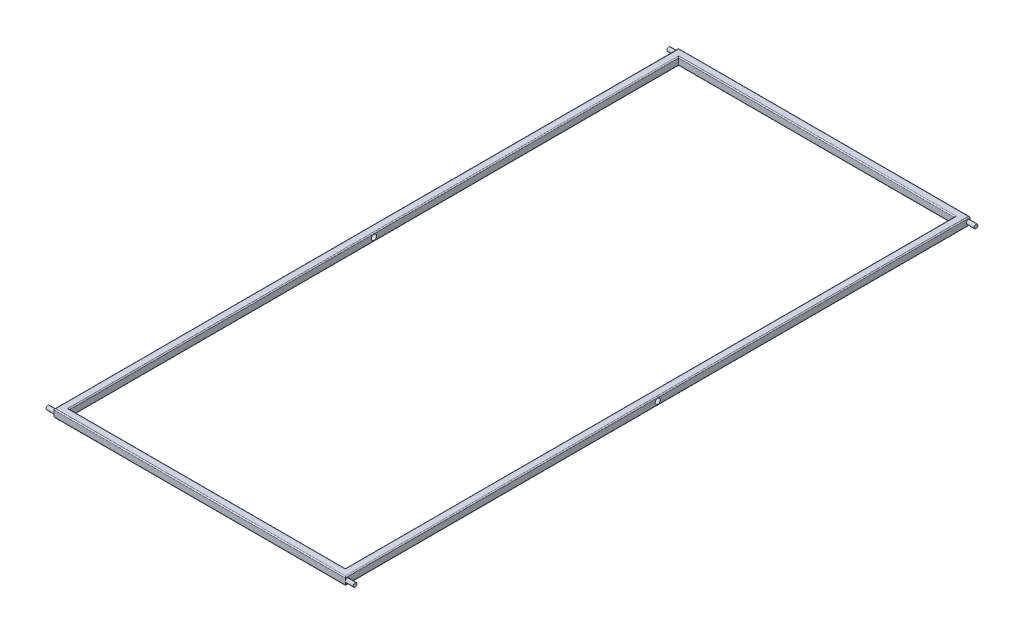
ISO-10303-21;
HEADER;
FILE_DESCRIPTION(('STEP AP214'),'2;1');
FILE_NAME('part.step','',(''),(''),'','','');
FILE_SCHEMA(('AUTOMOTIVE_DESIGN { 1 0 10303 214 1 1 1 1 }'));
ENDSEC;
DATA;
#1=APPLICATION_CONTEXT('core data for automotive mechanical design processes');
#2=APPLICATION_PROTOCOL_DEFINITION('international standard','automotive_design',2000,#1);
#3=PRODUCT_CONTEXT('',#1,'mechanical');
#4=PRODUCT('Part','Part','',(#3));
#5=PRODUCT_RELATED_PRODUCT_CATEGORY('part','',(#4));
#6=PRODUCT_DEFINITION_FORMATION('','',#4);
#7=PRODUCT_DEFINITION_CONTEXT('part definition',#1,'design');
#8=PRODUCT_DEFINITION('design','',#6,#7);
#9=PRODUCT_DEFINITION_SHAPE('','',#8);
#10=(LENGTH_UNIT() NAMED_UNIT(*) SI_UNIT(.MILLI.,.METRE.));
#11=(NAMED_UNIT(*) PLANE_ANGLE_UNIT() SI_UNIT($,.RADIAN.));
#12=(NAMED_UNIT(*) SI_UNIT($,.STERADIAN.) SOLID_ANGLE_UNIT());
#13=UNCERTAINTY_MEASURE_WITH_UNIT(LENGTH_MEASURE(1.E-05),#10,'distance_accuracy_value','');
#14=(GEOMETRIC_REPRESENTATION_CONTEXT(3) GLOBAL_UNCERTAINTY_ASSIGNED_CONTEXT((#13)) GLOBAL_UNIT_ASSIGNED_CONTEXT((#10,
#11,#12)) REPRESENTATION_CONTEXT('',''));
#15=CARTESIAN_POINT('',(0.,0.,0.));
#16=DIRECTION('',(0.,0.,1.));
#17=DIRECTION('',(1.,0.,0.));
#18=AXIS2_PLACEMENT_3D('',#15,#16,#17);
#19=CARTESIAN_POINT('',(0.,19.5,0.));
#20=DIRECTION('',(0.,-1.,0.));
#21=DIRECTION('',(0.,0.,-1.));
#22=AXIS2_PLACEMENT_3D('',#19,#20,#21);
#23=PLANE('',#22);
#24=DIRECTION('',(0.,0.,-1.));
#25=VECTOR('',#24,1.);
#26=CARTESIAN_POINT('',(347.1,19.5,760.5));
#27=LINE('',#26,#25);
#28=CARTESIAN_POINT('',(347.1,19.5,-763.1));
#29=VERTEX_POINT('',#28);
#30=CARTESIAN_POINT('',(347.1,19.5,763.1));
#31=VERTEX_POINT('',#30);
#32=EDGE_CURVE('E212',#29,#31,#27,.F.);
#33=ORIENTED_EDGE('',*,*,#32,.T.);
#34=DIRECTION('',(1.,0.,0.));
#35=VECTOR('',#34,1.);
#36=CARTESIAN_POINT('',(-344.5,19.5,763.1));
#37=LINE('',#36,#35);
#38=CARTESIAN_POINT('',(-347.1,19.5,763.1));
#39=VERTEX_POINT('',#38);
#40=EDGE_CURVE('E221',#31,#39,#37,.F.);
#41=ORIENTED_EDGE('',*,*,#40,.T.);
#42=DIRECTION('',(0.,0.,1.));
#43=VECTOR('',#42,1.);
#44=CARTESIAN_POINT('',(-347.1,19.5,-760.5));
#45=LINE('',#44,#43);
#46=CARTESIAN_POINT('',(-347.1,19.5,-763.1));
#47=VERTEX_POINT('',#46);
#48=EDGE_CURVE('E218',#39,#47,#45,.F.);
#49=ORIENTED_EDGE('',*,*,#48,.T.);
#50=DIRECTION('',(-1.,0.,0.));
#51=VECTOR('',#50,1.);
#52=CARTESIAN_POINT('',(344.5,19.5,-763.1));
#53=LINE('',#52,#51);
#54=EDGE_CURVE('E215',#47,#29,#53,.F.);
#55=ORIENTED_EDGE('',*,*,#54,.T.);
#56=EDGE_LOOP('',(#33,#41,#49,#55));
#57=FACE_BOUND('',#56,.T.);
#58=DIRECTION('',(1.,0.,0.));
#59=VECTOR('',#58,1.);
#60=CARTESIAN_POINT('',(0.,19.5,777.4));
#61=LINE('',#60,#59);
#62=CARTESIAN_POINT('',(-361.4,19.5,777.4));
#63=VERTEX_POINT('',#62);
#64=CARTESIAN_POINT('',(361.4,19.5,777.4));
#65=VERTEX_POINT('',#64);
#66=EDGE_CURVE('E205',#63,#65,#61,.T.);
#67=ORIENTED_EDGE('',*,*,#66,.T.);
#68=DIRECTION('',(0.,0.,-1.));
#69=VECTOR('',#68,1.);
#70=CARTESIAN_POINT('',(361.4,19.5,0.));
#71=LINE('',#70,#69);
#72=CARTESIAN_POINT('',(361.4,19.5,-777.4));
#73=VERTEX_POINT('',#72);
#74=EDGE_CURVE('E208',#65,#73,#71,.T.);
#75=ORIENTED_EDGE('',*,*,#74,.T.);
#76=DIRECTION('',(-1.,0.,0.));
#77=VECTOR('',#76,1.);
#78=CARTESIAN_POINT('',(0.,19.5,-777.4));
#79=LINE('',#78,#77);
#80=CARTESIAN_POINT('',(-361.4,19.5,-777.4));
#81=VERTEX_POINT('',#80);
#82=EDGE_CURVE('E199',#73,#81,#79,.T.);
#83=ORIENTED_EDGE('',*,*,#82,.T.);
#84=DIRECTION('',(0.,0.,1.));
#85=VECTOR('',#84,1.);
#86=CARTESIAN_POINT('',(-361.4,19.5,0.));
#87=LINE('',#86,#85);
#88=EDGE_CURVE('E202',#81,#63,#87,.T.);
#89=ORIENTED_EDGE('',*,*,#88,.T.);
#90=EDGE_LOOP('',(#67,#75,#83,#89));
#91=FACE_BOUND('',#90,.T.);
#92=ADVANCED_FACE('F38',(#57,#91),#23,.F.);
#93=CARTESIAN_POINT('',(0.,0.,0.));
#94=DIRECTION('',(0.,-1.,0.));
#95=DIRECTION('',(0.,0.,-1.));
#96=AXIS2_PLACEMENT_3D('',#93,#94,#95);
#97=PLANE('',#96);
#98=DIRECTION('',(-1.,0.,0.));
#99=VECTOR('',#98,1.);
#100=CARTESIAN_POINT('',(0.,0.,-763.1));
#101=LINE('',#100,#99);
#102=CARTESIAN_POINT('',(347.1,0.,-763.1));
#103=VERTEX_POINT('',#102);
#104=CARTESIAN_POINT('',(-347.1,0.,-763.1));
#105=VERTEX_POINT('',#104);
#106=EDGE_CURVE('E295',#103,#105,#101,.T.);
#107=ORIENTED_EDGE('',*,*,#106,.T.);
#108=DIRECTION('',(0.,0.,1.));
#109=VECTOR('',#108,1.);
#110=CARTESIAN_POINT('',(-347.1,0.,0.));
#111=LINE('',#110,#109);
#112=CARTESIAN_POINT('',(-347.1,0.,763.1));
#113=VERTEX_POINT('',#112);
#114=EDGE_CURVE('E298',#105,#113,#111,.T.);
#115=ORIENTED_EDGE('',*,*,#114,.T.);
#116=DIRECTION('',(1.,0.,0.));
#117=VECTOR('',#116,1.);
#118=CARTESIAN_POINT('',(0.,0.,763.1));
#119=LINE('',#118,#117);
#120=CARTESIAN_POINT('',(347.1,0.,763.1));
#121=VERTEX_POINT('',#120);
#122=EDGE_CURVE('E289',#113,#121,#119,.T.);
#123=ORIENTED_EDGE('',*,*,#122,.T.);
#124=DIRECTION('',(0.,0.,-1.));
#125=VECTOR('',#124,1.);
#126=CARTESIAN_POINT('',(347.1,0.,0.));
#127=LINE('',#126,#125);
#128=EDGE_CURVE('E292',#121,#103,#127,.T.);
#129=ORIENTED_EDGE('',*,*,#128,.T.);
#130=EDGE_LOOP('',(#107,#115,#123,#129));
#131=FACE_BOUND('',#130,.T.);
#132=DIRECTION('',(0.,0.,1.));
#133=VECTOR('',#132,1.);
#134=CARTESIAN_POINT('',(-361.4,0.,-780.));
#135=LINE('',#134,#133);
#136=CARTESIAN_POINT('',(-361.4,0.,777.4));
#137=VERTEX_POINT('',#136);
#138=CARTESIAN_POINT('',(-361.4,0.,-777.4));
#139=VERTEX_POINT('',#138);
#140=EDGE_CURVE('E282',#137,#139,#135,.F.);
#141=ORIENTED_EDGE('',*,*,#140,.T.);
#142=DIRECTION('',(-1.,0.,0.));
#143=VECTOR('',#142,1.);
#144=CARTESIAN_POINT('',(364.,0.,-777.4));
#145=LINE('',#144,#143);
#146=CARTESIAN_POINT('',(361.4,0.,-777.4));
#147=VERTEX_POINT('',#146);
#148=EDGE_CURVE('E285',#139,#147,#145,.F.);
#149=ORIENTED_EDGE('',*,*,#148,.T.);
#150=DIRECTION('',(0.,0.,-1.));
#151=VECTOR('',#150,1.);
#152=CARTESIAN_POINT('',(361.4,0.,780.));
#153=LINE('',#152,#151);
#154=CARTESIAN_POINT('',(361.4,0.,777.4));
#155=VERTEX_POINT('',#154);
#156=EDGE_CURVE('E246',#147,#155,#153,.F.);
#157=ORIENTED_EDGE('',*,*,#156,.T.);
#158=DIRECTION('',(1.,0.,0.));
#159=VECTOR('',#158,1.);
#160=CARTESIAN_POINT('',(-364.,0.,777.4));
#161=LINE('',#160,#159);
#162=EDGE_CURVE('E279',#155,#137,#161,.F.);
#163=ORIENTED_EDGE('',*,*,#162,.T.);
#164=EDGE_LOOP('',(#141,#149,#157,#163));
#165=FACE_BOUND('',#164,.T.);
#166=ADVANCED_FACE('F361',(#131,#165),#97,.T.);
#167=CARTESIAN_POINT('',(364.,19.5,780.));
#168=DIRECTION('',(-1.,0.,0.));
#169=DIRECTION('',(0.,0.,1.));
#170=AXIS2_PLACEMENT_3D('',#167,#168,#169);
#171=PLANE('',#170);
#172=CARTESIAN_POINT('',(364.,9.75,1.4432899320127E-13));
#173=DIRECTION('',(-1.,0.,0.));
#174=DIRECTION('',(0.,0.,1.));
#175=AXIS2_PLACEMENT_3D('',#172,#173,#174);
#176=CIRCLE('',#175,6.5);
#177=CARTESIAN_POINT('',(364.,9.75,6.50000000000015));
#178=VERTEX_POINT('',#177);
#179=EDGE_CURVE('E418',#178,#178,#176,.T.);
#180=ORIENTED_EDGE('',*,*,#179,.T.);
#181=EDGE_LOOP('',(#180));
#182=FACE_BOUND('',#181,.T.);
#183=DIRECTION('',(0.,-1.,0.));
#184=VECTOR('',#183,1.);
#185=CARTESIAN_POINT('',(364.,19.5,-780.));
#186=LINE('',#185,#184);
#187=CARTESIAN_POINT('',(364.,9.75,-780.));
#188=VERTEX_POINT('',#187);
#189=CARTESIAN_POINT('',(364.,2.6,-780.));
#190=VERTEX_POINT('',#189);
#191=EDGE_CURVE('E175',#188,#190,#186,.T.);
#192=ORIENTED_EDGE('',*,*,#191,.F.);
#193=CARTESIAN_POINT('',(364.,9.75,-775.125));
#194=DIRECTION('',(-1.,0.,0.));
#195=DIRECTION('',(0.,0.,-1.));
#196=AXIS2_PLACEMENT_3D('',#193,#194,#195);
#197=CIRCLE('',#196,4.87499999999997);
#198=EDGE_CURVE('E54',#188,#188,#197,.T.);
#199=ORIENTED_EDGE('',*,*,#198,.T.);
#200=CARTESIAN_POINT('',(364.,16.9,-780.));
#201=VERTEX_POINT('',#200);
#202=EDGE_CURVE('E192',#201,#188,#186,.T.);
#203=ORIENTED_EDGE('',*,*,#202,.F.);
#204=DIRECTION('',(0.,0.,-1.));
#205=VECTOR('',#204,1.);
#206=CARTESIAN_POINT('',(364.,16.9,780.));
#207=LINE('',#206,#205);
#208=CARTESIAN_POINT('',(364.,16.9,780.));
#209=VERTEX_POINT('',#208);
#210=EDGE_CURVE('E234',#201,#209,#207,.F.);
#211=ORIENTED_EDGE('',*,*,#210,.T.);
#212=DIRECTION('',(0.,-1.,0.));
#213=VECTOR('',#212,1.);
#214=CARTESIAN_POINT('',(364.,19.5,780.));
#215=LINE('',#214,#213);
#216=CARTESIAN_POINT('',(364.,9.75,780.));
#217=VERTEX_POINT('',#216);
#218=EDGE_CURVE('E375',#209,#217,#215,.T.);
#219=ORIENTED_EDGE('',*,*,#218,.T.);
#220=CARTESIAN_POINT('',(364.,9.75,775.125));
#221=DIRECTION('',(-1.,0.,0.));
#222=DIRECTION('',(0.,0.,1.));
#223=AXIS2_PLACEMENT_3D('',#220,#221,#222);
#224=CIRCLE('',#223,4.87499999999997);
#225=EDGE_CURVE('E59',#217,#217,#224,.T.);
#226=ORIENTED_EDGE('',*,*,#225,.T.);
#227=CARTESIAN_POINT('',(364.,2.6,780.));
#228=VERTEX_POINT('',#227);
#229=EDGE_CURVE('E378',#217,#228,#215,.T.);
#230=ORIENTED_EDGE('',*,*,#229,.T.);
#231=DIRECTION('',(0.,0.,-1.));
#232=VECTOR('',#231,1.);
#233=CARTESIAN_POINT('',(364.,2.6,-780.));
#234=LINE('',#233,#232);
#235=EDGE_CURVE('E11',#228,#190,#234,.T.);
#236=ORIENTED_EDGE('',*,*,#235,.T.);
#237=EDGE_LOOP('',(#192,#199,#203,#211,#219,#226,#230,#236));
#238=FACE_BOUND('',#237,.T.);
#239=ADVANCED_FACE('F497',(#182,#238),#171,.F.);
#240=CARTESIAN_POINT('',(-364.,19.5,-780.));
#241=DIRECTION('',(0.,0.,1.));
#242=DIRECTION('',(1.,0.,0.));
#243=AXIS2_PLACEMENT_3D('',#240,#241,#242);
#244=PLANE('',#243);
#245=ORIENTED_EDGE('',*,*,#202,.T.);
#246=ORIENTED_EDGE('',*,*,#191,.T.);
#247=DIRECTION('',(-1.,0.,0.));
#248=VECTOR('',#247,1.);
#249=CARTESIAN_POINT('',(-364.,2.6,-780.));
#250=LINE('',#249,#248);
#251=CARTESIAN_POINT('',(-364.,2.6,-780.));
#252=VERTEX_POINT('',#251);
#253=EDGE_CURVE('E182',#190,#252,#250,.T.);
#254=ORIENTED_EDGE('',*,*,#253,.T.);
#255=DIRECTION('',(0.,-1.,0.));
#256=VECTOR('',#255,1.);
#257=CARTESIAN_POINT('',(-364.,19.5,-780.));
#258=LINE('',#257,#256);
#259=CARTESIAN_POINT('',(-364.,9.75,-780.));
#260=VERTEX_POINT('',#259);
#261=EDGE_CURVE('E176',#260,#252,#258,.T.);
#262=ORIENTED_EDGE('',*,*,#261,.F.);
#263=CARTESIAN_POINT('',(-364.,16.9,-780.));
#264=VERTEX_POINT('',#263);
#265=EDGE_CURVE('E164',#264,#260,#258,.T.);
#266=ORIENTED_EDGE('',*,*,#265,.F.);
#267=DIRECTION('',(-1.,0.,0.));
#268=VECTOR('',#267,1.);
#269=CARTESIAN_POINT('',(-364.,16.9,-780.));
#270=LINE('',#269,#268);
#271=EDGE_CURVE('E243',#264,#201,#270,.F.);
#272=ORIENTED_EDGE('',*,*,#271,.T.);
#273=EDGE_LOOP('',(#245,#246,#254,#262,#266,#272));
#274=FACE_BOUND('',#273,.T.);
#275=ADVANCED_FACE('F180',(#274),#244,.F.);
#276=CARTESIAN_POINT('',(-364.,19.5,780.));
#277=DIRECTION('',(1.,0.,0.));
#278=DIRECTION('',(0.,0.,-1.));
#279=AXIS2_PLACEMENT_3D('',#276,#277,#278);
#280=PLANE('',#279);
#281=CARTESIAN_POINT('',(-364.,9.75,1.4432899320127E-13));
#282=DIRECTION('',(-1.,0.,0.));
#283=DIRECTION('',(0.,0.,1.));
#284=AXIS2_PLACEMENT_3D('',#281,#282,#283);
#285=CIRCLE('',#284,6.5);
#286=CARTESIAN_POINT('',(-364.,9.75,6.50000000000015));
#287=VERTEX_POINT('',#286);
#288=EDGE_CURVE('E429',#287,#287,#285,.T.);
#289=ORIENTED_EDGE('',*,*,#288,.F.);
#290=EDGE_LOOP('',(#289));
#291=FACE_BOUND('',#290,.T.);
#292=ORIENTED_EDGE('',*,*,#265,.T.);
#293=CARTESIAN_POINT('',(-364.,9.75,-775.125));
#294=DIRECTION('',(-1.,0.,0.));
#295=DIRECTION('',(0.,0.,-1.));
#296=AXIS2_PLACEMENT_3D('',#293,#294,#295);
#297=CIRCLE('',#296,4.87499999999997);
#298=EDGE_CURVE('E168',#260,#260,#297,.T.);
#299=ORIENTED_EDGE('',*,*,#298,.F.);
#300=ORIENTED_EDGE('',*,*,#261,.T.);
#301=DIRECTION('',(0.,0.,1.));
#302=VECTOR('',#301,1.);
#303=CARTESIAN_POINT('',(-364.,2.6,780.));
#304=LINE('',#303,#302);
#305=CARTESIAN_POINT('',(-364.,2.6,780.));
#306=VERTEX_POINT('',#305);
#307=EDGE_CURVE('E317',#252,#306,#304,.T.);
#308=ORIENTED_EDGE('',*,*,#307,.T.);
#309=DIRECTION('',(0.,-1.,0.));
#310=VECTOR('',#309,1.);
#311=CARTESIAN_POINT('',(-364.,19.5,780.));
#312=LINE('',#311,#310);
#313=CARTESIAN_POINT('',(-364.,9.75,780.));
#314=VERTEX_POINT('',#313);
#315=EDGE_CURVE('E188',#314,#306,#312,.T.);
#316=ORIENTED_EDGE('',*,*,#315,.F.);
#317=CARTESIAN_POINT('',(-364.,9.75,775.125));
#318=DIRECTION('',(-1.,0.,0.));
#319=DIRECTION('',(0.,0.,1.));
#320=AXIS2_PLACEMENT_3D('',#317,#318,#319);
#321=CIRCLE('',#320,4.87499999999997);
#322=EDGE_CURVE('E372',#314,#314,#321,.T.);
#323=ORIENTED_EDGE('',*,*,#322,.F.);
#324=CARTESIAN_POINT('',(-364.,16.9,780.));
#325=VERTEX_POINT('',#324);
#326=EDGE_CURVE('E186',#325,#314,#312,.T.);
#327=ORIENTED_EDGE('',*,*,#326,.F.);
#328=DIRECTION('',(0.,0.,1.));
#329=VECTOR('',#328,1.);
#330=CARTESIAN_POINT('',(-364.,16.9,780.));
#331=LINE('',#330,#329);
#332=EDGE_CURVE('E171',#325,#264,#331,.F.);
#333=ORIENTED_EDGE('',*,*,#332,.T.);
#334=EDGE_LOOP('',(#292,#299,#300,#308,#316,#323,#327,#333));
#335=FACE_BOUND('',#334,.T.);
#336=ADVANCED_FACE('F166',(#291,#335),#280,.F.);
#337=CARTESIAN_POINT('',(-364.,19.5,780.));
#338=DIRECTION('',(0.,0.,-1.));
#339=DIRECTION('',(-1.,0.,0.));
#340=AXIS2_PLACEMENT_3D('',#337,#338,#339);
#341=PLANE('',#340);
#342=ORIENTED_EDGE('',*,*,#326,.T.);
#343=ORIENTED_EDGE('',*,*,#315,.T.);
#344=DIRECTION('',(1.,0.,0.));
#345=VECTOR('',#344,1.);
#346=CARTESIAN_POINT('',(364.,2.6,780.));
#347=LINE('',#346,#345);
#348=EDGE_CURVE('E48',#306,#228,#347,.T.);
#349=ORIENTED_EDGE('',*,*,#348,.T.);
#350=ORIENTED_EDGE('',*,*,#229,.F.);
#351=ORIENTED_EDGE('',*,*,#218,.F.);
#352=DIRECTION('',(1.,0.,0.));
#353=VECTOR('',#352,1.);
#354=CARTESIAN_POINT('',(-364.,16.9,780.));
#355=LINE('',#354,#353);
#356=EDGE_CURVE('E238',#209,#325,#355,.F.);
#357=ORIENTED_EDGE('',*,*,#356,.T.);
#358=EDGE_LOOP('',(#342,#343,#349,#350,#351,#357));
#359=FACE_BOUND('',#358,.T.);
#360=ADVANCED_FACE('F503',(#359),#341,.F.);
#361=CARTESIAN_POINT('',(344.5,19.5,760.5));
#362=DIRECTION('',(-1.,0.,0.));
#363=DIRECTION('',(0.,0.,1.));
#364=AXIS2_PLACEMENT_3D('',#361,#362,#363);
#365=PLANE('',#364);
#366=CARTESIAN_POINT('',(344.5,9.75,1.4432899320127E-13));
#367=DIRECTION('',(-1.,0.,0.));
#368=DIRECTION('',(0.,0.,1.));
#369=AXIS2_PLACEMENT_3D('',#366,#367,#368);
#370=CIRCLE('',#369,6.5);
#371=CARTESIAN_POINT('',(344.5,9.75,6.50000000000015));
#372=VERTEX_POINT('',#371);
#373=EDGE_CURVE('E425',#372,#372,#370,.T.);
#374=ORIENTED_EDGE('',*,*,#373,.F.);
#375=EDGE_LOOP('',(#374));
#376=FACE_BOUND('',#375,.T.);
#377=DIRECTION('',(0.,-1.,0.));
#378=VECTOR('',#377,1.);
#379=CARTESIAN_POINT('',(344.5,19.5,-760.5));
#380=LINE('',#379,#378);
#381=CARTESIAN_POINT('',(344.5,16.9,-760.5));
#382=VERTEX_POINT('',#381);
#383=CARTESIAN_POINT('',(344.5,2.6,-760.5));
#384=VERTEX_POINT('',#383);
#385=EDGE_CURVE('E382',#382,#384,#380,.T.);
#386=ORIENTED_EDGE('',*,*,#385,.T.);
#387=DIRECTION('',(0.,0.,-1.));
#388=VECTOR('',#387,1.);
#389=CARTESIAN_POINT('',(344.5,2.6,760.5));
#390=LINE('',#389,#388);
#391=CARTESIAN_POINT('',(344.5,2.6,760.5));
#392=VERTEX_POINT('',#391);
#393=EDGE_CURVE('E309',#384,#392,#390,.F.);
#394=ORIENTED_EDGE('',*,*,#393,.T.);
#395=DIRECTION('',(0.,-1.,0.));
#396=VECTOR('',#395,1.);
#397=CARTESIAN_POINT('',(344.5,19.5,760.5));
#398=LINE('',#397,#396);
#399=CARTESIAN_POINT('',(344.5,16.9,760.5));
#400=VERTEX_POINT('',#399);
#401=EDGE_CURVE('E262',#400,#392,#398,.T.);
#402=ORIENTED_EDGE('',*,*,#401,.F.);
#403=DIRECTION('',(0.,0.,-1.));
#404=VECTOR('',#403,1.);
#405=CARTESIAN_POINT('',(344.5,16.9,-760.5));
#406=LINE('',#405,#404);
#407=EDGE_CURVE('E231',#400,#382,#406,.T.);
#408=ORIENTED_EDGE('',*,*,#407,.T.);
#409=EDGE_LOOP('',(#386,#394,#402,#408));
#410=FACE_BOUND('',#409,.T.);
#411=ADVANCED_FACE('F474',(#376,#410),#365,.T.);
#412=CARTESIAN_POINT('',(-344.5,19.5,-760.5));
#413=DIRECTION('',(0.,0.,1.));
#414=DIRECTION('',(1.,0.,0.));
#415=AXIS2_PLACEMENT_3D('',#412,#413,#414);
#416=PLANE('',#415);
#417=DIRECTION('',(0.,-1.,0.));
#418=VECTOR('',#417,1.);
#419=CARTESIAN_POINT('',(-344.5,19.5,-760.5));
#420=LINE('',#419,#418);
#421=CARTESIAN_POINT('',(-344.5,16.9,-760.5));
#422=VERTEX_POINT('',#421);
#423=CARTESIAN_POINT('',(-344.5,2.6,-760.5));
#424=VERTEX_POINT('',#423);
#425=EDGE_CURVE('E387',#422,#424,#420,.T.);
#426=ORIENTED_EDGE('',*,*,#425,.T.);
#427=DIRECTION('',(-1.,0.,0.));
#428=VECTOR('',#427,1.);
#429=CARTESIAN_POINT('',(-344.5,2.6,-760.5));
#430=LINE('',#429,#428);
#431=EDGE_CURVE('E306',#424,#384,#430,.F.);
#432=ORIENTED_EDGE('',*,*,#431,.T.);
#433=ORIENTED_EDGE('',*,*,#385,.F.);
#434=DIRECTION('',(-1.,0.,0.));
#435=VECTOR('',#434,1.);
#436=CARTESIAN_POINT('',(-344.5,16.9,-760.5));
#437=LINE('',#436,#435);
#438=EDGE_CURVE('E228',#382,#422,#437,.T.);
#439=ORIENTED_EDGE('',*,*,#438,.T.);
#440=EDGE_LOOP('',(#426,#432,#433,#439));
#441=FACE_BOUND('',#440,.T.);
#442=ADVANCED_FACE('F444',(#441),#416,.T.);
#443=CARTESIAN_POINT('',(-344.5,19.5,760.5));
#444=DIRECTION('',(1.,0.,0.));
#445=DIRECTION('',(0.,0.,-1.));
#446=AXIS2_PLACEMENT_3D('',#443,#444,#445);
#447=PLANE('',#446);
#448=CARTESIAN_POINT('',(-344.5,9.75,1.4432899320127E-13));
#449=DIRECTION('',(1.,0.,0.));
#450=DIRECTION('',(0.,0.,-1.));
#451=AXIS2_PLACEMENT_3D('',#448,#449,#450);
#452=CIRCLE('',#451,6.5);
#453=CARTESIAN_POINT('',(-344.5,9.75,-6.49999999999986));
#454=VERTEX_POINT('',#453);
#455=EDGE_CURVE('E42',#454,#454,#452,.T.);
#456=ORIENTED_EDGE('',*,*,#455,.F.);
#457=EDGE_LOOP('',(#456));
#458=FACE_BOUND('',#457,.T.);
#459=DIRECTION('',(0.,-1.,0.));
#460=VECTOR('',#459,1.);
#461=CARTESIAN_POINT('',(-344.5,19.5,760.5));
#462=LINE('',#461,#460);
#463=CARTESIAN_POINT('',(-344.5,16.9,760.5));
#464=VERTEX_POINT('',#463);
#465=CARTESIAN_POINT('',(-344.5,2.6,760.5));
#466=VERTEX_POINT('',#465);
#467=EDGE_CURVE('E391',#464,#466,#462,.T.);
#468=ORIENTED_EDGE('',*,*,#467,.T.);
#469=DIRECTION('',(0.,0.,1.));
#470=VECTOR('',#469,1.);
#471=CARTESIAN_POINT('',(-344.5,2.6,760.5));
#472=LINE('',#471,#470);
#473=EDGE_CURVE('E302',#466,#424,#472,.F.);
#474=ORIENTED_EDGE('',*,*,#473,.T.);
#475=ORIENTED_EDGE('',*,*,#425,.F.);
#476=DIRECTION('',(0.,0.,1.));
#477=VECTOR('',#476,1.);
#478=CARTESIAN_POINT('',(-344.5,16.9,760.5));
#479=LINE('',#478,#477);
#480=EDGE_CURVE('E225',#422,#464,#479,.T.);
#481=ORIENTED_EDGE('',*,*,#480,.T.);
#482=EDGE_LOOP('',(#468,#474,#475,#481));
#483=FACE_BOUND('',#482,.T.);
#484=ADVANCED_FACE('F440',(#458,#483),#447,.T.);
#485=CARTESIAN_POINT('',(-344.5,19.5,760.5));
#486=DIRECTION('',(0.,0.,-1.));
#487=DIRECTION('',(-1.,0.,0.));
#488=AXIS2_PLACEMENT_3D('',#485,#486,#487);
#489=PLANE('',#488);
#490=ORIENTED_EDGE('',*,*,#401,.T.);
#491=DIRECTION('',(1.,0.,0.));
#492=VECTOR('',#491,1.);
#493=CARTESIAN_POINT('',(-344.5,2.6,760.5));
#494=LINE('',#493,#492);
#495=EDGE_CURVE('E312',#392,#466,#494,.F.);
#496=ORIENTED_EDGE('',*,*,#495,.T.);
#497=ORIENTED_EDGE('',*,*,#467,.F.);
#498=DIRECTION('',(1.,0.,0.));
#499=VECTOR('',#498,1.);
#500=CARTESIAN_POINT('',(344.5,16.9,760.5));
#501=LINE('',#500,#499);
#502=EDGE_CURVE('E195',#464,#400,#501,.T.);
#503=ORIENTED_EDGE('',*,*,#502,.T.);
#504=EDGE_LOOP('',(#490,#496,#497,#503));
#505=FACE_BOUND('',#504,.T.);
#506=ADVANCED_FACE('F443',(#505),#489,.T.);
#507=CARTESIAN_POINT('',(-344.5,16.9,-763.1));
#508=DIRECTION('',(1.,0.,0.));
#509=DIRECTION('',(0.,0.,-1.));
#510=AXIS2_PLACEMENT_3D('',#507,#508,#509);
#511=CYLINDRICAL_SURFACE('',#510,2.6);
#512=CARTESIAN_POINT('',(347.1,16.9,-763.1));
#513=DIRECTION('',(0.707106781186547,0.,0.707106781186547));
#514=DIRECTION('',(0.707106781186547,0.,-0.707106781186547));
#515=AXIS2_PLACEMENT_3D('',#512,#513,#514);
#516=ELLIPSE('',#515,3.67695526217005,2.6);
#517=EDGE_CURVE('E254',#29,#382,#516,.T.);
#518=ORIENTED_EDGE('',*,*,#517,.F.);
#519=ORIENTED_EDGE('',*,*,#54,.F.);
#520=CARTESIAN_POINT('',(-347.1,16.9,-763.1));
#521=DIRECTION('',(0.707106781186547,0.,-0.707106781186547));
#522=DIRECTION('',(-0.707106781186547,0.,-0.707106781186547));
#523=AXIS2_PLACEMENT_3D('',#520,#521,#522);
#524=ELLIPSE('',#523,3.67695526217005,2.6);
#525=EDGE_CURVE('E258',#422,#47,#524,.F.);
#526=ORIENTED_EDGE('',*,*,#525,.F.);
#527=ORIENTED_EDGE('',*,*,#438,.F.);
#528=EDGE_LOOP('',(#518,#519,#526,#527));
#529=FACE_BOUND('',#528,.T.);
#530=ADVANCED_FACE('F526',(#529),#511,.T.);
#531=CARTESIAN_POINT('',(-347.1,16.9,760.5));
#532=DIRECTION('',(0.,0.,-1.));
#533=DIRECTION('',(-1.,0.,0.));
#534=AXIS2_PLACEMENT_3D('',#531,#532,#533);
#535=CYLINDRICAL_SURFACE('',#534,2.6);
#536=ORIENTED_EDGE('',*,*,#525,.T.);
#537=ORIENTED_EDGE('',*,*,#48,.F.);
#538=CARTESIAN_POINT('',(-347.1,16.9,763.1));
#539=DIRECTION('',(-0.707106781186547,0.,-0.707106781186547));
#540=DIRECTION('',(-0.707106781186547,0.,0.707106781186547));
#541=AXIS2_PLACEMENT_3D('',#538,#539,#540);
#542=ELLIPSE('',#541,3.67695526217005,2.6);
#543=EDGE_CURVE('E250',#464,#39,#542,.F.);
#544=ORIENTED_EDGE('',*,*,#543,.F.);
#545=ORIENTED_EDGE('',*,*,#480,.F.);
#546=EDGE_LOOP('',(#536,#537,#544,#545));
#547=FACE_BOUND('',#546,.T.);
#548=ADVANCED_FACE('F522',(#547),#535,.T.);
#549=CARTESIAN_POINT('',(347.1,16.9,760.5));
#550=DIRECTION('',(0.,0.,1.));
#551=DIRECTION('',(1.,0.,0.));
#552=AXIS2_PLACEMENT_3D('',#549,#550,#551);
#553=CYLINDRICAL_SURFACE('',#552,2.6);
#554=ORIENTED_EDGE('',*,*,#517,.T.);
#555=ORIENTED_EDGE('',*,*,#407,.F.);
#556=CARTESIAN_POINT('',(347.1,16.9,763.1));
#557=DIRECTION('',(-0.707106781186547,0.,0.707106781186547));
#558=DIRECTION('',(-0.707106781186547,0.,-0.707106781186547));
#559=AXIS2_PLACEMENT_3D('',#556,#557,#558);
#560=ELLIPSE('',#559,3.67695526217005,2.6);
#561=EDGE_CURVE('E247',#31,#400,#560,.T.);
#562=ORIENTED_EDGE('',*,*,#561,.F.);
#563=ORIENTED_EDGE('',*,*,#32,.F.);
#564=EDGE_LOOP('',(#554,#555,#562,#563));
#565=FACE_BOUND('',#564,.T.);
#566=ADVANCED_FACE('F518',(#565),#553,.T.);
#567=CARTESIAN_POINT('',(-344.5,16.9,763.1));
#568=DIRECTION('',(-1.,0.,0.));
#569=DIRECTION('',(0.,0.,1.));
#570=AXIS2_PLACEMENT_3D('',#567,#568,#569);
#571=CYLINDRICAL_SURFACE('',#570,2.6);
#572=ORIENTED_EDGE('',*,*,#543,.T.);
#573=ORIENTED_EDGE('',*,*,#40,.F.);
#574=ORIENTED_EDGE('',*,*,#561,.T.);
#575=ORIENTED_EDGE('',*,*,#502,.F.);
#576=EDGE_LOOP('',(#572,#573,#574,#575));
#577=FACE_BOUND('',#576,.T.);
#578=ADVANCED_FACE('F514',(#577),#571,.T.);
#579=CARTESIAN_POINT('',(-361.4,16.9,0.));
#580=DIRECTION('',(0.,0.,1.));
#581=DIRECTION('',(1.,0.,0.));
#582=AXIS2_PLACEMENT_3D('',#579,#580,#581);
#583=CYLINDRICAL_SURFACE('',#582,2.6);
#584=CARTESIAN_POINT('',(-361.4,16.9,-777.4));
#585=DIRECTION('',(-0.707106781186547,0.,0.707106781186547));
#586=DIRECTION('',(-0.707106781186547,0.,-0.707106781186547));
#587=AXIS2_PLACEMENT_3D('',#584,#585,#586);
#588=ELLIPSE('',#587,3.67695526217005,2.6);
#589=EDGE_CURVE('E270',#264,#81,#588,.F.);
#590=ORIENTED_EDGE('',*,*,#589,.F.);
#591=ORIENTED_EDGE('',*,*,#332,.F.);
#592=CARTESIAN_POINT('',(-361.4,16.9,777.4));
#593=DIRECTION('',(0.707106781186547,0.,0.707106781186547));
#594=DIRECTION('',(-0.707106781186547,0.,0.707106781186547));
#595=AXIS2_PLACEMENT_3D('',#592,#593,#594);
#596=ELLIPSE('',#595,3.67695526217005,2.6);
#597=EDGE_CURVE('E251',#63,#325,#596,.T.);
#598=ORIENTED_EDGE('',*,*,#597,.F.);
#599=ORIENTED_EDGE('',*,*,#88,.F.);
#600=EDGE_LOOP('',(#590,#591,#598,#599));
#601=FACE_BOUND('',#600,.T.);
#602=ADVANCED_FACE('F517',(#601),#583,.T.);
#603=CARTESIAN_POINT('',(0.,16.9,777.4));
#604=DIRECTION('',(1.,0.,0.));
#605=DIRECTION('',(0.,0.,-1.));
#606=AXIS2_PLACEMENT_3D('',#603,#604,#605);
#607=CYLINDRICAL_SURFACE('',#606,2.6);
#608=ORIENTED_EDGE('',*,*,#597,.T.);
#609=ORIENTED_EDGE('',*,*,#356,.F.);
#610=CARTESIAN_POINT('',(361.4,16.9,777.4));
#611=DIRECTION('',(0.707106781186547,0.,-0.707106781186547));
#612=DIRECTION('',(0.707106781186547,0.,0.707106781186547));
#613=AXIS2_PLACEMENT_3D('',#610,#611,#612);
#614=ELLIPSE('',#613,3.67695526217005,2.6);
#615=EDGE_CURVE('E266',#65,#209,#614,.T.);
#616=ORIENTED_EDGE('',*,*,#615,.F.);
#617=ORIENTED_EDGE('',*,*,#66,.F.);
#618=EDGE_LOOP('',(#608,#609,#616,#617));
#619=FACE_BOUND('',#618,.T.);
#620=ADVANCED_FACE('F533',(#619),#607,.T.);
#621=CARTESIAN_POINT('',(0.,16.9,-777.4));
#622=DIRECTION('',(-1.,0.,0.));
#623=DIRECTION('',(0.,0.,1.));
#624=AXIS2_PLACEMENT_3D('',#621,#622,#623);
#625=CYLINDRICAL_SURFACE('',#624,2.6);
#626=ORIENTED_EDGE('',*,*,#589,.T.);
#627=ORIENTED_EDGE('',*,*,#82,.F.);
#628=CARTESIAN_POINT('',(361.4,16.9,-777.4));
#629=DIRECTION('',(-0.707106781186547,0.,-0.707106781186547));
#630=DIRECTION('',(-0.707106781186547,0.,0.707106781186547));
#631=AXIS2_PLACEMENT_3D('',#628,#629,#630);
#632=ELLIPSE('',#631,3.67695526217005,2.6);
#633=EDGE_CURVE('E263',#201,#73,#632,.F.);
#634=ORIENTED_EDGE('',*,*,#633,.F.);
#635=ORIENTED_EDGE('',*,*,#271,.F.);
#636=EDGE_LOOP('',(#626,#627,#634,#635));
#637=FACE_BOUND('',#636,.T.);
#638=ADVANCED_FACE('F487',(#637),#625,.T.);
#639=CARTESIAN_POINT('',(361.4,16.9,0.));
#640=DIRECTION('',(0.,0.,-1.));
#641=DIRECTION('',(-1.,0.,0.));
#642=AXIS2_PLACEMENT_3D('',#639,#640,#641);
#643=CYLINDRICAL_SURFACE('',#642,2.6);
#644=ORIENTED_EDGE('',*,*,#615,.T.);
#645=ORIENTED_EDGE('',*,*,#210,.F.);
#646=ORIENTED_EDGE('',*,*,#633,.T.);
#647=ORIENTED_EDGE('',*,*,#74,.F.);
#648=EDGE_LOOP('',(#644,#645,#646,#647));
#649=FACE_BOUND('',#648,.T.);
#650=ADVANCED_FACE('F480',(#649),#643,.T.);
#651=CARTESIAN_POINT('',(347.1,2.6,0.));
#652=DIRECTION('',(0.,0.,-1.));
#653=DIRECTION('',(-1.,0.,0.));
#654=AXIS2_PLACEMENT_3D('',#651,#652,#653);
#655=CYLINDRICAL_SURFACE('',#654,2.6);
#656=CARTESIAN_POINT('',(347.1,2.6,763.1));
#657=DIRECTION('',(0.707106781186547,0.,-0.707106781186547));
#658=DIRECTION('',(-0.707106781186547,0.,-0.707106781186547));
#659=AXIS2_PLACEMENT_3D('',#656,#657,#658);
#660=ELLIPSE('',#659,3.67695526217005,2.6);
#661=EDGE_CURVE('E330',#392,#121,#660,.F.);
#662=ORIENTED_EDGE('',*,*,#661,.F.);
#663=ORIENTED_EDGE('',*,*,#393,.F.);
#664=CARTESIAN_POINT('',(347.1,2.6,-763.1));
#665=DIRECTION('',(-0.707106781186547,0.,-0.707106781186547));
#666=DIRECTION('',(-0.707106781186547,0.,0.707106781186547));
#667=AXIS2_PLACEMENT_3D('',#664,#665,#666);
#668=ELLIPSE('',#667,3.67695526217005,2.6);
#669=EDGE_CURVE('E267',#103,#384,#668,.T.);
#670=ORIENTED_EDGE('',*,*,#669,.F.);
#671=ORIENTED_EDGE('',*,*,#128,.F.);
#672=EDGE_LOOP('',(#662,#663,#670,#671));
#673=FACE_BOUND('',#672,.T.);
#674=ADVANCED_FACE('F478',(#673),#655,.T.);
#675=CARTESIAN_POINT('',(0.,2.6,-763.1));
#676=DIRECTION('',(-1.,0.,0.));
#677=DIRECTION('',(0.,0.,1.));
#678=AXIS2_PLACEMENT_3D('',#675,#676,#677);
#679=CYLINDRICAL_SURFACE('',#678,2.6);
#680=ORIENTED_EDGE('',*,*,#669,.T.);
#681=ORIENTED_EDGE('',*,*,#431,.F.);
#682=CARTESIAN_POINT('',(-347.1,2.6,-763.1));
#683=DIRECTION('',(-0.707106781186547,0.,0.707106781186547));
#684=DIRECTION('',(0.707106781186547,0.,0.707106781186547));
#685=AXIS2_PLACEMENT_3D('',#682,#683,#684);
#686=ELLIPSE('',#685,3.67695526217005,2.6);
#687=EDGE_CURVE('E326',#105,#424,#686,.T.);
#688=ORIENTED_EDGE('',*,*,#687,.F.);
#689=ORIENTED_EDGE('',*,*,#106,.F.);
#690=EDGE_LOOP('',(#680,#681,#688,#689));
#691=FACE_BOUND('',#690,.T.);
#692=ADVANCED_FACE('F468',(#691),#679,.T.);
#693=CARTESIAN_POINT('',(0.,2.6,763.1));
#694=DIRECTION('',(1.,0.,0.));
#695=DIRECTION('',(0.,0.,-1.));
#696=AXIS2_PLACEMENT_3D('',#693,#694,#695);
#697=CYLINDRICAL_SURFACE('',#696,2.6);
#698=ORIENTED_EDGE('',*,*,#661,.T.);
#699=ORIENTED_EDGE('',*,*,#122,.F.);
#700=CARTESIAN_POINT('',(-347.1,2.6,763.1));
#701=DIRECTION('',(0.707106781186547,0.,0.707106781186547));
#702=DIRECTION('',(-0.707106781186547,0.,0.707106781186547));
#703=AXIS2_PLACEMENT_3D('',#700,#701,#702);
#704=ELLIPSE('',#703,3.67695526217005,2.6);
#705=EDGE_CURVE('E323',#466,#113,#704,.F.);
#706=ORIENTED_EDGE('',*,*,#705,.F.);
#707=ORIENTED_EDGE('',*,*,#495,.F.);
#708=EDGE_LOOP('',(#698,#699,#706,#707));
#709=FACE_BOUND('',#708,.T.);
#710=ADVANCED_FACE('F461',(#709),#697,.T.);
#711=CARTESIAN_POINT('',(-347.1,2.6,0.));
#712=DIRECTION('',(0.,0.,1.));
#713=DIRECTION('',(1.,0.,0.));
#714=AXIS2_PLACEMENT_3D('',#711,#712,#713);
#715=CYLINDRICAL_SURFACE('',#714,2.6);
#716=ORIENTED_EDGE('',*,*,#687,.T.);
#717=ORIENTED_EDGE('',*,*,#473,.F.);
#718=ORIENTED_EDGE('',*,*,#705,.T.);
#719=ORIENTED_EDGE('',*,*,#114,.F.);
#720=EDGE_LOOP('',(#716,#717,#718,#719));
#721=FACE_BOUND('',#720,.T.);
#722=ADVANCED_FACE('F454',(#721),#715,.T.);
#723=CARTESIAN_POINT('',(-364.,2.6,777.4));
#724=DIRECTION('',(-1.,0.,0.));
#725=DIRECTION('',(0.,0.,1.));
#726=AXIS2_PLACEMENT_3D('',#723,#724,#725);
#727=CYLINDRICAL_SURFACE('',#726,2.6);
#728=CARTESIAN_POINT('',(-361.4,2.6,777.4));
#729=DIRECTION('',(-0.707106781186547,0.,-0.707106781186547));
#730=DIRECTION('',(-0.707106781186547,0.,0.707106781186547));
#731=AXIS2_PLACEMENT_3D('',#728,#729,#730);
#732=ELLIPSE('',#731,3.67695526217005,2.6);
#733=EDGE_CURVE('E344',#137,#306,#732,.T.);
#734=ORIENTED_EDGE('',*,*,#733,.F.);
#735=ORIENTED_EDGE('',*,*,#162,.F.);
#736=CARTESIAN_POINT('',(361.4,2.6,777.4));
#737=DIRECTION('',(-0.707106781186547,0.,0.707106781186547));
#738=DIRECTION('',(0.707106781186547,0.,0.707106781186547));
#739=AXIS2_PLACEMENT_3D('',#736,#737,#738);
#740=ELLIPSE('',#739,3.67695526217005,2.6);
#741=EDGE_CURVE('E327',#228,#155,#740,.F.);
#742=ORIENTED_EDGE('',*,*,#741,.F.);
#743=ORIENTED_EDGE('',*,*,#348,.F.);
#744=EDGE_LOOP('',(#734,#735,#742,#743));
#745=FACE_BOUND('',#744,.T.);
#746=ADVANCED_FACE('F40',(#745),#727,.T.);
#747=CARTESIAN_POINT('',(361.4,2.6,780.));
#748=DIRECTION('',(0.,0.,1.));
#749=DIRECTION('',(1.,0.,0.));
#750=AXIS2_PLACEMENT_3D('',#747,#748,#749);
#751=CYLINDRICAL_SURFACE('',#750,2.6);
#752=ORIENTED_EDGE('',*,*,#741,.T.);
#753=ORIENTED_EDGE('',*,*,#156,.F.);
#754=CARTESIAN_POINT('',(361.4,2.6,-777.4));
#755=DIRECTION('',(0.707106781186547,0.,0.707106781186547));
#756=DIRECTION('',(-0.707106781186547,0.,0.707106781186547));
#757=AXIS2_PLACEMENT_3D('',#754,#755,#756);
#758=ELLIPSE('',#757,3.67695526217005,2.6);
#759=EDGE_CURVE('E340',#190,#147,#758,.F.);
#760=ORIENTED_EDGE('',*,*,#759,.F.);
#761=ORIENTED_EDGE('',*,*,#235,.F.);
#762=EDGE_LOOP('',(#752,#753,#760,#761));
#763=FACE_BOUND('',#762,.T.);
#764=ADVANCED_FACE('F353',(#763),#751,.T.);
#765=CARTESIAN_POINT('',(-361.4,2.6,780.));
#766=DIRECTION('',(0.,0.,-1.));
#767=DIRECTION('',(-1.,0.,0.));
#768=AXIS2_PLACEMENT_3D('',#765,#766,#767);
#769=CYLINDRICAL_SURFACE('',#768,2.6);
#770=ORIENTED_EDGE('',*,*,#733,.T.);
#771=ORIENTED_EDGE('',*,*,#307,.F.);
#772=CARTESIAN_POINT('',(-361.4,2.6,-777.4));
#773=DIRECTION('',(0.707106781186547,0.,-0.707106781186547));
#774=DIRECTION('',(-0.707106781186547,0.,-0.707106781186547));
#775=AXIS2_PLACEMENT_3D('',#772,#773,#774);
#776=ELLIPSE('',#775,3.67695526217005,2.6);
#777=EDGE_CURVE('E337',#139,#252,#776,.T.);
#778=ORIENTED_EDGE('',*,*,#777,.F.);
#779=ORIENTED_EDGE('',*,*,#140,.F.);
#780=EDGE_LOOP('',(#770,#771,#778,#779));
#781=FACE_BOUND('',#780,.T.);
#782=ADVANCED_FACE('F368',(#781),#769,.T.);
#783=CARTESIAN_POINT('',(-364.,2.6,-777.4));
#784=DIRECTION('',(1.,0.,0.));
#785=DIRECTION('',(0.,0.,-1.));
#786=AXIS2_PLACEMENT_3D('',#783,#784,#785);
#787=CYLINDRICAL_SURFACE('',#786,2.6);
#788=ORIENTED_EDGE('',*,*,#759,.T.);
#789=ORIENTED_EDGE('',*,*,#148,.F.);
#790=ORIENTED_EDGE('',*,*,#777,.T.);
#791=ORIENTED_EDGE('',*,*,#253,.F.);
#792=EDGE_LOOP('',(#788,#789,#790,#791));
#793=FACE_BOUND('',#792,.T.);
#794=ADVANCED_FACE('F365',(#793),#787,.T.);
#795=CARTESIAN_POINT('',(-383.5,9.75,775.125));
#796=DIRECTION('',(1.,0.,0.));
#797=DIRECTION('',(0.,0.,-1.));
#798=AXIS2_PLACEMENT_3D('',#795,#796,#797);
#799=CYLINDRICAL_SURFACE('',#798,4.87499999999997);
#800=CARTESIAN_POINT('',(-383.5,9.75,775.125));
#801=DIRECTION('',(-1.,0.,0.));
#802=DIRECTION('',(0.,0.,1.));
#803=AXIS2_PLACEMENT_3D('',#800,#801,#802);
#804=CIRCLE('',#803,4.87499999999997);
#805=CARTESIAN_POINT('',(-383.5,9.75,780.));
#806=VERTEX_POINT('',#805);
#807=EDGE_CURVE('E341',#806,#806,#804,.T.);
#808=ORIENTED_EDGE('',*,*,#807,.F.);
#809=EDGE_LOOP('',(#808));
#810=FACE_BOUND('',#809,.T.);
#811=ORIENTED_EDGE('',*,*,#322,.T.);
#812=EDGE_LOOP('',(#811));
#813=FACE_BOUND('',#812,.T.);
#814=ADVANCED_FACE('F574',(#810,#813),#799,.T.);
#815=CARTESIAN_POINT('',(-383.5,9.75,775.125));
#816=DIRECTION('',(-1.,0.,0.));
#817=DIRECTION('',(0.,0.,1.));
#818=AXIS2_PLACEMENT_3D('',#815,#816,#817);
#819=PLANE('',#818);
#820=ORIENTED_EDGE('',*,*,#807,.T.);
#821=EDGE_LOOP('',(#820));
#822=FACE_BOUND('',#821,.T.);
#823=ADVANCED_FACE('F580',(#822),#819,.T.);
#824=CARTESIAN_POINT('',(-383.5,9.75,-775.125));
#825=DIRECTION('',(1.,0.,0.));
#826=DIRECTION('',(0.,0.,-1.));
#827=AXIS2_PLACEMENT_3D('',#824,#825,#826);
#828=CYLINDRICAL_SURFACE('',#827,4.87499999999997);
#829=CARTESIAN_POINT('',(-383.5,9.75,-775.125));
#830=DIRECTION('',(-1.,0.,0.));
#831=DIRECTION('',(0.,0.,-1.));
#832=AXIS2_PLACEMENT_3D('',#829,#830,#831);
#833=CIRCLE('',#832,4.87499999999997);
#834=CARTESIAN_POINT('',(-383.5,9.75,-780.));
#835=VERTEX_POINT('',#834);
#836=EDGE_CURVE('E400',#835,#835,#833,.T.);
#837=ORIENTED_EDGE('',*,*,#836,.F.);
#838=EDGE_LOOP('',(#837));
#839=FACE_BOUND('',#838,.T.);
#840=ORIENTED_EDGE('',*,*,#298,.T.);
#841=EDGE_LOOP('',(#840));
#842=FACE_BOUND('',#841,.T.);
#843=ADVANCED_FACE('F588',(#839,#842),#828,.T.);
#844=CARTESIAN_POINT('',(-383.5,9.75,-775.125));
#845=DIRECTION('',(1.,0.,0.));
#846=DIRECTION('',(0.,0.,-1.));
#847=AXIS2_PLACEMENT_3D('',#844,#845,#846);
#848=PLANE('',#847);
#849=ORIENTED_EDGE('',*,*,#836,.T.);
#850=EDGE_LOOP('',(#849));
#851=FACE_BOUND('',#850,.T.);
#852=ADVANCED_FACE('F596',(#851),#848,.F.);
#853=CARTESIAN_POINT('',(383.5,9.75,775.125));
#854=DIRECTION('',(-1.,0.,0.));
#855=DIRECTION('',(0.,0.,1.));
#856=AXIS2_PLACEMENT_3D('',#853,#854,#855);
#857=CYLINDRICAL_SURFACE('',#856,4.87499999999997);
#858=CARTESIAN_POINT('',(383.5,9.75,775.125));
#859=DIRECTION('',(-1.,0.,0.));
#860=DIRECTION('',(0.,0.,1.));
#861=AXIS2_PLACEMENT_3D('',#858,#859,#860);
#862=CIRCLE('',#861,4.87499999999997);
#863=CARTESIAN_POINT('',(383.5,9.75,780.));
#864=VERTEX_POINT('',#863);
#865=EDGE_CURVE('E406',#864,#864,#862,.T.);
#866=ORIENTED_EDGE('',*,*,#865,.T.);
#867=EDGE_LOOP('',(#866));
#868=FACE_BOUND('',#867,.T.);
#869=ORIENTED_EDGE('',*,*,#225,.F.);
#870=EDGE_LOOP('',(#869));
#871=FACE_BOUND('',#870,.T.);
#872=ADVANCED_FACE('F604',(#868,#871),#857,.T.);
#873=CARTESIAN_POINT('',(383.5,9.75,775.125));
#874=DIRECTION('',(1.,0.,0.));
#875=DIRECTION('',(0.,0.,1.));
#876=AXIS2_PLACEMENT_3D('',#873,#874,#875);
#877=PLANE('',#876);
#878=ORIENTED_EDGE('',*,*,#865,.F.);
#879=EDGE_LOOP('',(#878));
#880=FACE_BOUND('',#879,.T.);
#881=ADVANCED_FACE('F612',(#880),#877,.T.);
#882=CARTESIAN_POINT('',(383.5,9.75,-775.125));
#883=DIRECTION('',(-1.,0.,0.));
#884=DIRECTION('',(0.,0.,1.));
#885=AXIS2_PLACEMENT_3D('',#882,#883,#884);
#886=CYLINDRICAL_SURFACE('',#885,4.87499999999997);
#887=CARTESIAN_POINT('',(383.5,9.75,-775.125));
#888=DIRECTION('',(-1.,0.,0.));
#889=DIRECTION('',(0.,0.,-1.));
#890=AXIS2_PLACEMENT_3D('',#887,#888,#889);
#891=CIRCLE('',#890,4.87499999999997);
#892=CARTESIAN_POINT('',(383.5,9.75,-780.));
#893=VERTEX_POINT('',#892);
#894=EDGE_CURVE('E412',#893,#893,#891,.T.);
#895=ORIENTED_EDGE('',*,*,#894,.T.);
#896=EDGE_LOOP('',(#895));
#897=FACE_BOUND('',#896,.T.);
#898=ORIENTED_EDGE('',*,*,#198,.F.);
#899=EDGE_LOOP('',(#898));
#900=FACE_BOUND('',#899,.T.);
#901=ADVANCED_FACE('F620',(#897,#900),#886,.T.);
#902=CARTESIAN_POINT('',(383.5,9.75,-775.125));
#903=DIRECTION('',(-1.,0.,0.));
#904=DIRECTION('',(0.,0.,-1.));
#905=AXIS2_PLACEMENT_3D('',#902,#903,#904);
#906=PLANE('',#905);
#907=ORIENTED_EDGE('',*,*,#894,.F.);
#908=EDGE_LOOP('',(#907));
#909=FACE_BOUND('',#908,.T.);
#910=ADVANCED_FACE('F628',(#909),#906,.F.);
#911=CARTESIAN_POINT('',(383.5,9.75,1.4432899320127E-13));
#912=DIRECTION('',(-1.,0.,0.));
#913=DIRECTION('',(0.,0.,1.));
#914=AXIS2_PLACEMENT_3D('',#911,#912,#913);
#915=CYLINDRICAL_SURFACE('',#914,6.5);
#916=ORIENTED_EDGE('',*,*,#455,.T.);
#917=EDGE_LOOP('',(#916));
#918=FACE_BOUND('',#917,.T.);
#919=ORIENTED_EDGE('',*,*,#288,.T.);
#920=EDGE_LOOP('',(#919));
#921=FACE_BOUND('',#920,.T.);
#922=ADVANCED_FACE('F438',(#918,#921),#915,.F.);
#923=ORIENTED_EDGE('',*,*,#373,.T.);
#924=EDGE_LOOP('',(#923));
#925=FACE_BOUND('',#924,.T.);
#926=ORIENTED_EDGE('',*,*,#179,.F.);
#927=EDGE_LOOP('',(#926));
#928=FACE_BOUND('',#927,.T.);
#929=ADVANCED_FACE('F643',(#925,#928),#915,.F.);
#930=CLOSED_SHELL('',(#92,#166,#239,#275,#336,#360,#411,#442,#484,#506,#530,#548,#566,#578,#602,
#620,#638,#650,#674,#692,#710,#722,#746,#764,#782,#794,#814,#823,#843,#852,#872,#881,#901,#910,
#922,#929));
#931=MANIFOLD_SOLID_BREP('B2',#930);
#932=ADVANCED_BREP_SHAPE_REPRESENTATION('',(#18,#931),#14);
#933=SHAPE_DEFINITION_REPRESENTATION(#9,#932);
ENDSEC;
END-ISO-10303-21;
